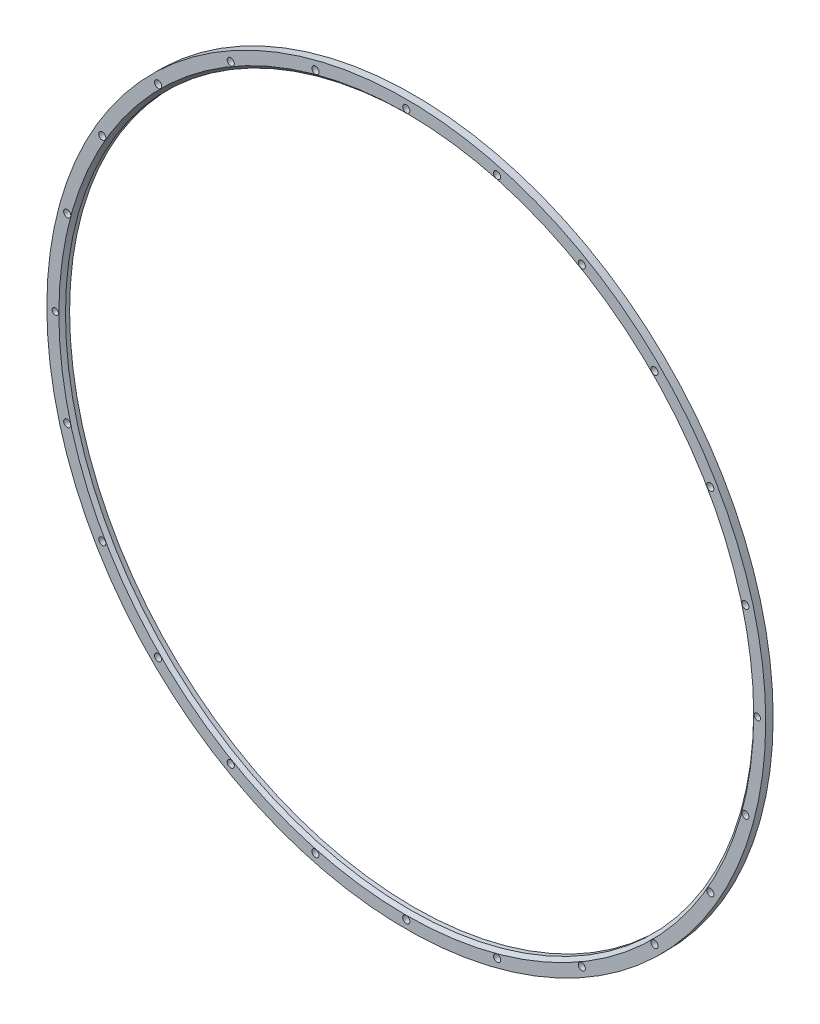
ISO-10303-21;
HEADER;
FILE_DESCRIPTION(('STEP AP214'),'2;1');
FILE_NAME('part.step','',(''),(''),'','','');
FILE_SCHEMA(('AUTOMOTIVE_DESIGN { 1 0 10303 214 1 1 1 1 }'));
ENDSEC;
DATA;
#1=APPLICATION_CONTEXT('core data for automotive mechanical design processes');
#2=APPLICATION_PROTOCOL_DEFINITION('international standard','automotive_design',2000,#1);
#3=PRODUCT_CONTEXT('',#1,'mechanical');
#4=PRODUCT('Part','Part','',(#3));
#5=PRODUCT_RELATED_PRODUCT_CATEGORY('part','',(#4));
#6=PRODUCT_DEFINITION_FORMATION('','',#4);
#7=PRODUCT_DEFINITION_CONTEXT('part definition',#1,'design');
#8=PRODUCT_DEFINITION('design','',#6,#7);
#9=PRODUCT_DEFINITION_SHAPE('','',#8);
#10=(LENGTH_UNIT() NAMED_UNIT(*) SI_UNIT(.MILLI.,.METRE.));
#11=(NAMED_UNIT(*) PLANE_ANGLE_UNIT() SI_UNIT($,.RADIAN.));
#12=(NAMED_UNIT(*) SI_UNIT($,.STERADIAN.) SOLID_ANGLE_UNIT());
#13=UNCERTAINTY_MEASURE_WITH_UNIT(LENGTH_MEASURE(1.E-05),#10,'distance_accuracy_value','');
#14=(GEOMETRIC_REPRESENTATION_CONTEXT(3) GLOBAL_UNCERTAINTY_ASSIGNED_CONTEXT((#13)) GLOBAL_UNIT_ASSIGNED_CONTEXT((#10,
#11,#12)) REPRESENTATION_CONTEXT('',''));
#15=CARTESIAN_POINT('',(0.,0.,0.));
#16=DIRECTION('',(0.,0.,1.));
#17=DIRECTION('',(1.,0.,0.));
#18=AXIS2_PLACEMENT_3D('',#15,#16,#17);
#19=CARTESIAN_POINT('',(0.,0.,4.7));
#20=DIRECTION('',(0.,0.,1.));
#21=DIRECTION('',(1.,0.,0.));
#22=AXIS2_PLACEMENT_3D('',#19,#20,#21);
#23=PLANE('',#22);
#24=CARTESIAN_POINT('',(0.,0.,4.7));
#25=DIRECTION('',(0.,0.,1.));
#26=DIRECTION('',(1.,0.,0.));
#27=AXIS2_PLACEMENT_3D('',#24,#25,#26);
#28=CIRCLE('',#27,219.725);
#29=CARTESIAN_POINT('',(219.725,0.,4.7));
#30=VERTEX_POINT('',#29);
#31=EDGE_CURVE('E43',#30,#30,#28,.F.);
#32=ORIENTED_EDGE('',*,*,#31,.T.);
#33=EDGE_LOOP('',(#32));
#34=FACE_BOUND('',#33,.T.);
#35=CARTESIAN_POINT('',(-57.4578280127567,214.435533436174,4.7));
#36=DIRECTION('',(0.,0.,1.));
#37=DIRECTION('',(0.965925826289072,0.258819045102508,0.));
#38=AXIS2_PLACEMENT_3D('',#35,#36,#37);
#39=CIRCLE('',#38,2.25);
#40=CARTESIAN_POINT('',(-55.2844949036063,215.017876287655,4.7));
#41=VERTEX_POINT('',#40);
#42=EDGE_CURVE('E185',#41,#41,#39,.T.);
#43=ORIENTED_EDGE('',*,*,#42,.F.);
#44=EDGE_LOOP('',(#43));
#45=FACE_BOUND('',#44,.T.);
#46=CARTESIAN_POINT('',(-110.999999999998,192.257639640147,4.7));
#47=DIRECTION('',(0.,0.,1.));
#48=DIRECTION('',(0.866025403784445,0.499999999999989,0.));
#49=AXIS2_PLACEMENT_3D('',#46,#47,#48);
#50=CIRCLE('',#49,2.25);
#51=CARTESIAN_POINT('',(-109.051442841483,193.382639640147,4.7));
#52=VERTEX_POINT('',#51);
#53=EDGE_CURVE('E179',#52,#52,#50,.T.);
#54=ORIENTED_EDGE('',*,*,#53,.F.);
#55=EDGE_LOOP('',(#54));
#56=FACE_BOUND('',#55,.T.);
#57=CARTESIAN_POINT('',(-156.977705423412,156.977705423415,4.7));
#58=DIRECTION('',(0.,0.,1.));
#59=DIRECTION('',(0.707106781186556,0.707106781186539,0.));
#60=AXIS2_PLACEMENT_3D('',#57,#58,#59);
#61=CIRCLE('',#60,2.25);
#62=CARTESIAN_POINT('',(-155.386715165742,158.568695681085,4.7));
#63=VERTEX_POINT('',#62);
#64=EDGE_CURVE('E173',#63,#63,#61,.T.);
#65=ORIENTED_EDGE('',*,*,#64,.F.);
#66=EDGE_LOOP('',(#65));
#67=FACE_BOUND('',#66,.T.);
#68=CARTESIAN_POINT('',(-192.257639640144,111.000000000002,4.7));
#69=DIRECTION('',(0.,0.,1.));
#70=DIRECTION('',(0.50000000000001,0.866025403784433,0.));
#71=AXIS2_PLACEMENT_3D('',#68,#69,#70);
#72=CIRCLE('',#71,2.25);
#73=CARTESIAN_POINT('',(-191.132639640144,112.948557158517,4.7));
#74=VERTEX_POINT('',#73);
#75=EDGE_CURVE('E167',#74,#74,#72,.T.);
#76=ORIENTED_EDGE('',*,*,#75,.F.);
#77=EDGE_LOOP('',(#76));
#78=FACE_BOUND('',#77,.T.);
#79=CARTESIAN_POINT('',(-214.435533436173,57.457828012762,4.7));
#80=DIRECTION('',(0.,0.,1.));
#81=DIRECTION('',(0.258819045102531,0.965925826289065,0.));
#82=AXIS2_PLACEMENT_3D('',#79,#80,#81);
#83=CIRCLE('',#82,2.25);
#84=CARTESIAN_POINT('',(-213.853190584692,59.6311611219124,4.7));
#85=VERTEX_POINT('',#84);
#86=EDGE_CURVE('E161',#85,#85,#83,.T.);
#87=ORIENTED_EDGE('',*,*,#86,.F.);
#88=EDGE_LOOP('',(#87));
#89=FACE_BOUND('',#88,.T.);
#90=CARTESIAN_POINT('',(-214.435533436174,-57.4578280127575,4.7));
#91=DIRECTION('',(0.,0.,1.));
#92=DIRECTION('',(-0.258819045102511,0.965925826289071,0.));
#93=AXIS2_PLACEMENT_3D('',#90,#91,#92);
#94=CIRCLE('',#93,2.25);
#95=CARTESIAN_POINT('',(-215.017876287654,-55.2844949036071,4.7));
#96=VERTEX_POINT('',#95);
#97=EDGE_CURVE('E155',#96,#96,#94,.T.);
#98=ORIENTED_EDGE('',*,*,#97,.F.);
#99=EDGE_LOOP('',(#98));
#100=FACE_BOUND('',#99,.T.);
#101=CARTESIAN_POINT('',(-192.257639640146,-110.999999999998,4.7));
#102=DIRECTION('',(0.,0.,1.));
#103=DIRECTION('',(-0.499999999999992,0.866025403784443,0.));
#104=AXIS2_PLACEMENT_3D('',#101,#102,#103);
#105=CIRCLE('',#104,2.25);
#106=CARTESIAN_POINT('',(-193.382639640146,-109.051442841483,4.7));
#107=VERTEX_POINT('',#106);
#108=EDGE_CURVE('E149',#107,#107,#105,.T.);
#109=ORIENTED_EDGE('',*,*,#108,.F.);
#110=EDGE_LOOP('',(#109));
#111=FACE_BOUND('',#110,.T.);
#112=CARTESIAN_POINT('',(-156.977705423415,-156.977705423412,4.7));
#113=DIRECTION('',(0.,0.,1.));
#114=DIRECTION('',(-0.707106781186541,0.707106781186554,0.));
#115=AXIS2_PLACEMENT_3D('',#112,#113,#114);
#116=CIRCLE('',#115,2.25);
#117=CARTESIAN_POINT('',(-158.568695681085,-155.386715165742,4.7));
#118=VERTEX_POINT('',#117);
#119=EDGE_CURVE('E143',#118,#118,#116,.T.);
#120=ORIENTED_EDGE('',*,*,#119,.F.);
#121=EDGE_LOOP('',(#120));
#122=FACE_BOUND('',#121,.T.);
#123=CARTESIAN_POINT('',(-111.000000000002,-192.257639640144,4.7));
#124=DIRECTION('',(0.,0.,1.));
#125=DIRECTION('',(-0.866025403784435,0.500000000000007,0.));
#126=AXIS2_PLACEMENT_3D('',#123,#124,#125);
#127=CIRCLE('',#126,2.25);
#128=CARTESIAN_POINT('',(-112.948557158517,-191.132639640144,4.7));
#129=VERTEX_POINT('',#128);
#130=EDGE_CURVE('E137',#129,#129,#127,.T.);
#131=ORIENTED_EDGE('',*,*,#130,.F.);
#132=EDGE_LOOP('',(#131));
#133=FACE_BOUND('',#132,.T.);
#134=CARTESIAN_POINT('',(-57.4578280127612,-214.435533436173,4.7));
#135=DIRECTION('',(0.,0.,1.));
#136=DIRECTION('',(-0.965925826289066,0.258819045102528,0.));
#137=AXIS2_PLACEMENT_3D('',#134,#135,#136);
#138=CIRCLE('',#137,2.25);
#139=CARTESIAN_POINT('',(-59.6311611219116,-213.853190584692,4.7));
#140=VERTEX_POINT('',#139);
#141=EDGE_CURVE('E131',#140,#140,#138,.T.);
#142=ORIENTED_EDGE('',*,*,#141,.F.);
#143=EDGE_LOOP('',(#142));
#144=FACE_BOUND('',#143,.T.);
#145=CARTESIAN_POINT('',(0.,-222.,4.7));
#146=DIRECTION('',(0.,0.,1.));
#147=DIRECTION('',(-1.,0.,0.));
#148=AXIS2_PLACEMENT_3D('',#145,#146,#147);
#149=CIRCLE('',#148,2.25);
#150=CARTESIAN_POINT('',(-2.25,-222.,4.7));
#151=VERTEX_POINT('',#150);
#152=EDGE_CURVE('E125',#151,#151,#149,.T.);
#153=ORIENTED_EDGE('',*,*,#152,.F.);
#154=EDGE_LOOP('',(#153));
#155=FACE_BOUND('',#154,.T.);
#156=CARTESIAN_POINT('',(57.4578280127582,-214.435533436174,4.7));
#157=DIRECTION('',(0.,0.,1.));
#158=DIRECTION('',(-0.96592582628907,-0.258819045102515,0.));
#159=AXIS2_PLACEMENT_3D('',#156,#157,#158);
#160=CIRCLE('',#159,2.25);
#161=CARTESIAN_POINT('',(55.2844949036078,-215.017876287654,4.7));
#162=VERTEX_POINT('',#161);
#163=EDGE_CURVE('E119',#162,#162,#160,.T.);
#164=ORIENTED_EDGE('',*,*,#163,.F.);
#165=EDGE_LOOP('',(#164));
#166=FACE_BOUND('',#165,.T.);
#167=CARTESIAN_POINT('',(110.999999999999,-192.257639640146,4.7));
#168=DIRECTION('',(0.,0.,1.));
#169=DIRECTION('',(-0.866025403784442,-0.499999999999995,0.));
#170=AXIS2_PLACEMENT_3D('',#167,#168,#169);
#171=CIRCLE('',#170,2.25);
#172=CARTESIAN_POINT('',(109.051442841484,-193.382639640146,4.7));
#173=VERTEX_POINT('',#172);
#174=EDGE_CURVE('E113',#173,#173,#171,.T.);
#175=ORIENTED_EDGE('',*,*,#174,.F.);
#176=EDGE_LOOP('',(#175));
#177=FACE_BOUND('',#176,.T.);
#178=CARTESIAN_POINT('',(156.977705423413,-156.977705423414,4.7));
#179=DIRECTION('',(0.,0.,1.));
#180=DIRECTION('',(-0.707106781186551,-0.707106781186544,0.));
#181=AXIS2_PLACEMENT_3D('',#178,#179,#180);
#182=CIRCLE('',#181,2.25);
#183=CARTESIAN_POINT('',(155.386715165743,-158.568695681084,4.7));
#184=VERTEX_POINT('',#183);
#185=EDGE_CURVE('E107',#184,#184,#182,.T.);
#186=ORIENTED_EDGE('',*,*,#185,.F.);
#187=EDGE_LOOP('',(#186));
#188=FACE_BOUND('',#187,.T.);
#189=CARTESIAN_POINT('',(192.257639640145,-111.000000000001,4.7));
#190=DIRECTION('',(0.,0.,1.));
#191=DIRECTION('',(-0.500000000000004,-0.866025403784436,0.));
#192=AXIS2_PLACEMENT_3D('',#189,#190,#191);
#193=CIRCLE('',#192,2.25);
#194=CARTESIAN_POINT('',(191.132639640145,-112.948557158516,4.7));
#195=VERTEX_POINT('',#194);
#196=EDGE_CURVE('E101',#195,#195,#193,.T.);
#197=ORIENTED_EDGE('',*,*,#196,.F.);
#198=EDGE_LOOP('',(#197));
#199=FACE_BOUND('',#198,.T.);
#200=CARTESIAN_POINT('',(214.435533436173,-57.4578280127605,4.7));
#201=DIRECTION('',(0.,0.,1.));
#202=DIRECTION('',(-0.258819045102525,-0.965925826289067,0.));
#203=AXIS2_PLACEMENT_3D('',#200,#201,#202);
#204=CIRCLE('',#203,2.25);
#205=CARTESIAN_POINT('',(213.853190584692,-59.6311611219109,4.7));
#206=VERTEX_POINT('',#205);
#207=EDGE_CURVE('E95',#206,#206,#204,.T.);
#208=ORIENTED_EDGE('',*,*,#207,.F.);
#209=EDGE_LOOP('',(#208));
#210=FACE_BOUND('',#209,.T.);
#211=CARTESIAN_POINT('',(214.435533436173,57.457828012759,4.7));
#212=DIRECTION('',(0.,0.,1.));
#213=DIRECTION('',(0.258819045102518,-0.965925826289069,0.));
#214=AXIS2_PLACEMENT_3D('',#211,#212,#213);
#215=CIRCLE('',#214,2.25);
#216=CARTESIAN_POINT('',(215.017876287654,55.2844949036086,4.7));
#217=VERTEX_POINT('',#216);
#218=EDGE_CURVE('E89',#217,#217,#215,.T.);
#219=ORIENTED_EDGE('',*,*,#218,.F.);
#220=EDGE_LOOP('',(#219));
#221=FACE_BOUND('',#220,.T.);
#222=CARTESIAN_POINT('',(192.257639640146,111.,4.7));
#223=DIRECTION('',(0.,0.,1.));
#224=DIRECTION('',(0.499999999999998,-0.86602540378444,0.));
#225=AXIS2_PLACEMENT_3D('',#222,#223,#224);
#226=CIRCLE('',#225,2.25);
#227=CARTESIAN_POINT('',(193.382639640146,109.051442841485,4.7));
#228=VERTEX_POINT('',#227);
#229=EDGE_CURVE('E83',#228,#228,#226,.T.);
#230=ORIENTED_EDGE('',*,*,#229,.F.);
#231=EDGE_LOOP('',(#230));
#232=FACE_BOUND('',#231,.T.);
#233=CARTESIAN_POINT('',(156.977705423414,156.977705423413,4.7));
#234=DIRECTION('',(0.,0.,1.));
#235=DIRECTION('',(0.707106781186546,-0.707106781186549,0.));
#236=AXIS2_PLACEMENT_3D('',#233,#234,#235);
#237=CIRCLE('',#236,2.25);
#238=CARTESIAN_POINT('',(158.568695681084,155.386715165744,4.7));
#239=VERTEX_POINT('',#238);
#240=EDGE_CURVE('E77',#239,#239,#237,.T.);
#241=ORIENTED_EDGE('',*,*,#240,.F.);
#242=EDGE_LOOP('',(#241));
#243=FACE_BOUND('',#242,.T.);
#244=CARTESIAN_POINT('',(111.,192.257639640145,4.7));
#245=DIRECTION('',(0.,0.,1.));
#246=DIRECTION('',(0.866025403784438,-0.500000000000001,0.));
#247=AXIS2_PLACEMENT_3D('',#244,#245,#246);
#248=CIRCLE('',#247,2.25);
#249=CARTESIAN_POINT('',(112.948557158515,191.132639640145,4.7));
#250=VERTEX_POINT('',#249);
#251=EDGE_CURVE('E71',#250,#250,#248,.T.);
#252=ORIENTED_EDGE('',*,*,#251,.F.);
#253=EDGE_LOOP('',(#252));
#254=FACE_BOUND('',#253,.T.);
#255=CARTESIAN_POINT('',(57.4578280127597,214.435533436173,4.7));
#256=DIRECTION('',(0.,0.,1.));
#257=DIRECTION('',(0.965925826289068,-0.258819045102521,0.));
#258=AXIS2_PLACEMENT_3D('',#255,#256,#257);
#259=CIRCLE('',#258,2.25);
#260=CARTESIAN_POINT('',(59.6311611219101,213.853190584692,4.7));
#261=VERTEX_POINT('',#260);
#262=EDGE_CURVE('E65',#261,#261,#259,.T.);
#263=ORIENTED_EDGE('',*,*,#262,.F.);
#264=EDGE_LOOP('',(#263));
#265=FACE_BOUND('',#264,.T.);
#266=CARTESIAN_POINT('',(0.,222.,4.7));
#267=DIRECTION('',(0.,0.,1.));
#268=DIRECTION('',(1.,0.,0.));
#269=AXIS2_PLACEMENT_3D('',#266,#267,#268);
#270=CIRCLE('',#269,2.25);
#271=CARTESIAN_POINT('',(2.25,222.,4.7));
#272=VERTEX_POINT('',#271);
#273=EDGE_CURVE('E62',#272,#272,#270,.T.);
#274=ORIENTED_EDGE('',*,*,#273,.F.);
#275=EDGE_LOOP('',(#274));
#276=FACE_BOUND('',#275,.T.);
#277=CARTESIAN_POINT('',(0.,0.,4.7));
#278=DIRECTION('',(0.,0.,1.));
#279=DIRECTION('',(1.,0.,0.));
#280=AXIS2_PLACEMENT_3D('',#277,#278,#279);
#281=CIRCLE('',#280,227.325);
#282=CARTESIAN_POINT('',(227.325,0.,4.7));
#283=VERTEX_POINT('',#282);
#284=EDGE_CURVE('E47',#283,#283,#281,.T.);
#285=ORIENTED_EDGE('',*,*,#284,.T.);
#286=EDGE_LOOP('',(#285));
#287=FACE_BOUND('',#286,.T.);
#288=CARTESIAN_POINT('',(222.,-7.75108857223176E-13,4.7));
#289=DIRECTION('',(0.,0.,1.));
#290=DIRECTION('',(1.,0.,0.));
#291=AXIS2_PLACEMENT_3D('',#288,#289,#290);
#292=CIRCLE('',#291,2.);
#293=CARTESIAN_POINT('',(224.,-7.75108857223176E-13,4.7));
#294=VERTEX_POINT('',#293);
#295=EDGE_CURVE('E194',#294,#294,#292,.T.);
#296=ORIENTED_EDGE('',*,*,#295,.F.);
#297=EDGE_LOOP('',(#296));
#298=FACE_BOUND('',#297,.T.);
#299=CARTESIAN_POINT('',(-222.,2.32532657166953E-12,4.7));
#300=DIRECTION('',(0.,0.,1.));
#301=DIRECTION('',(1.,0.,0.));
#302=AXIS2_PLACEMENT_3D('',#299,#300,#301);
#303=CIRCLE('',#302,2.);
#304=CARTESIAN_POINT('',(-220.,2.32532657166953E-12,4.7));
#305=VERTEX_POINT('',#304);
#306=EDGE_CURVE('E200',#305,#305,#303,.T.);
#307=ORIENTED_EDGE('',*,*,#306,.F.);
#308=EDGE_LOOP('',(#307));
#309=FACE_BOUND('',#308,.T.);
#310=ADVANCED_FACE('F36',(#34,#45,#56,#67,#78,#89,#100,#111,#122,#133,#144,#155,#166,#177,#188,
#199,#210,#221,#232,#243,#254,#265,#276,#287,#298,#309),#23,.T.);
#311=CARTESIAN_POINT('',(0.,0.,0.));
#312=DIRECTION('',(0.,0.,1.));
#313=DIRECTION('',(1.,0.,0.));
#314=AXIS2_PLACEMENT_3D('',#311,#312,#313);
#315=PLANE('',#314);
#316=CARTESIAN_POINT('',(-57.4578280127567,214.435533436174,0.));
#317=DIRECTION('',(0.,0.,1.));
#318=DIRECTION('',(0.965925826289072,0.258819045102508,0.));
#319=AXIS2_PLACEMENT_3D('',#316,#317,#318);
#320=CIRCLE('',#319,2.25);
#321=CARTESIAN_POINT('',(-55.2844949036063,215.017876287655,0.));
#322=VERTEX_POINT('',#321);
#323=EDGE_CURVE('E188',#322,#322,#320,.T.);
#324=ORIENTED_EDGE('',*,*,#323,.T.);
#325=EDGE_LOOP('',(#324));
#326=FACE_BOUND('',#325,.T.);
#327=CARTESIAN_POINT('',(-110.999999999998,192.257639640147,0.));
#328=DIRECTION('',(0.,0.,1.));
#329=DIRECTION('',(0.866025403784445,0.499999999999989,0.));
#330=AXIS2_PLACEMENT_3D('',#327,#328,#329);
#331=CIRCLE('',#330,2.25);
#332=CARTESIAN_POINT('',(-109.051442841483,193.382639640147,0.));
#333=VERTEX_POINT('',#332);
#334=EDGE_CURVE('E182',#333,#333,#331,.T.);
#335=ORIENTED_EDGE('',*,*,#334,.T.);
#336=EDGE_LOOP('',(#335));
#337=FACE_BOUND('',#336,.T.);
#338=CARTESIAN_POINT('',(-156.977705423412,156.977705423415,0.));
#339=DIRECTION('',(0.,0.,1.));
#340=DIRECTION('',(0.707106781186556,0.707106781186539,0.));
#341=AXIS2_PLACEMENT_3D('',#338,#339,#340);
#342=CIRCLE('',#341,2.25);
#343=CARTESIAN_POINT('',(-155.386715165742,158.568695681085,0.));
#344=VERTEX_POINT('',#343);
#345=EDGE_CURVE('E176',#344,#344,#342,.T.);
#346=ORIENTED_EDGE('',*,*,#345,.T.);
#347=EDGE_LOOP('',(#346));
#348=FACE_BOUND('',#347,.T.);
#349=CARTESIAN_POINT('',(-192.257639640144,111.000000000002,0.));
#350=DIRECTION('',(0.,0.,1.));
#351=DIRECTION('',(0.50000000000001,0.866025403784433,0.));
#352=AXIS2_PLACEMENT_3D('',#349,#350,#351);
#353=CIRCLE('',#352,2.25);
#354=CARTESIAN_POINT('',(-191.132639640144,112.948557158517,0.));
#355=VERTEX_POINT('',#354);
#356=EDGE_CURVE('E170',#355,#355,#353,.T.);
#357=ORIENTED_EDGE('',*,*,#356,.T.);
#358=EDGE_LOOP('',(#357));
#359=FACE_BOUND('',#358,.T.);
#360=CARTESIAN_POINT('',(-214.435533436173,57.457828012762,0.));
#361=DIRECTION('',(0.,0.,1.));
#362=DIRECTION('',(0.258819045102531,0.965925826289065,0.));
#363=AXIS2_PLACEMENT_3D('',#360,#361,#362);
#364=CIRCLE('',#363,2.25);
#365=CARTESIAN_POINT('',(-213.853190584692,59.6311611219124,0.));
#366=VERTEX_POINT('',#365);
#367=EDGE_CURVE('E164',#366,#366,#364,.T.);
#368=ORIENTED_EDGE('',*,*,#367,.T.);
#369=EDGE_LOOP('',(#368));
#370=FACE_BOUND('',#369,.T.);
#371=CARTESIAN_POINT('',(-214.435533436174,-57.4578280127575,0.));
#372=DIRECTION('',(0.,0.,1.));
#373=DIRECTION('',(-0.258819045102511,0.965925826289071,0.));
#374=AXIS2_PLACEMENT_3D('',#371,#372,#373);
#375=CIRCLE('',#374,2.25);
#376=CARTESIAN_POINT('',(-215.017876287654,-55.2844949036071,0.));
#377=VERTEX_POINT('',#376);
#378=EDGE_CURVE('E158',#377,#377,#375,.T.);
#379=ORIENTED_EDGE('',*,*,#378,.T.);
#380=EDGE_LOOP('',(#379));
#381=FACE_BOUND('',#380,.T.);
#382=CARTESIAN_POINT('',(-192.257639640146,-110.999999999998,0.));
#383=DIRECTION('',(0.,0.,1.));
#384=DIRECTION('',(-0.499999999999992,0.866025403784443,0.));
#385=AXIS2_PLACEMENT_3D('',#382,#383,#384);
#386=CIRCLE('',#385,2.25);
#387=CARTESIAN_POINT('',(-193.382639640146,-109.051442841483,0.));
#388=VERTEX_POINT('',#387);
#389=EDGE_CURVE('E152',#388,#388,#386,.T.);
#390=ORIENTED_EDGE('',*,*,#389,.T.);
#391=EDGE_LOOP('',(#390));
#392=FACE_BOUND('',#391,.T.);
#393=CARTESIAN_POINT('',(-156.977705423415,-156.977705423412,0.));
#394=DIRECTION('',(0.,0.,1.));
#395=DIRECTION('',(-0.707106781186541,0.707106781186554,0.));
#396=AXIS2_PLACEMENT_3D('',#393,#394,#395);
#397=CIRCLE('',#396,2.25);
#398=CARTESIAN_POINT('',(-158.568695681085,-155.386715165742,0.));
#399=VERTEX_POINT('',#398);
#400=EDGE_CURVE('E146',#399,#399,#397,.T.);
#401=ORIENTED_EDGE('',*,*,#400,.T.);
#402=EDGE_LOOP('',(#401));
#403=FACE_BOUND('',#402,.T.);
#404=CARTESIAN_POINT('',(-111.000000000002,-192.257639640144,0.));
#405=DIRECTION('',(0.,0.,1.));
#406=DIRECTION('',(-0.866025403784435,0.500000000000007,0.));
#407=AXIS2_PLACEMENT_3D('',#404,#405,#406);
#408=CIRCLE('',#407,2.25);
#409=CARTESIAN_POINT('',(-112.948557158517,-191.132639640144,0.));
#410=VERTEX_POINT('',#409);
#411=EDGE_CURVE('E140',#410,#410,#408,.T.);
#412=ORIENTED_EDGE('',*,*,#411,.T.);
#413=EDGE_LOOP('',(#412));
#414=FACE_BOUND('',#413,.T.);
#415=CARTESIAN_POINT('',(-57.4578280127612,-214.435533436173,0.));
#416=DIRECTION('',(0.,0.,1.));
#417=DIRECTION('',(-0.965925826289066,0.258819045102528,0.));
#418=AXIS2_PLACEMENT_3D('',#415,#416,#417);
#419=CIRCLE('',#418,2.25);
#420=CARTESIAN_POINT('',(-59.6311611219116,-213.853190584692,0.));
#421=VERTEX_POINT('',#420);
#422=EDGE_CURVE('E134',#421,#421,#419,.T.);
#423=ORIENTED_EDGE('',*,*,#422,.T.);
#424=EDGE_LOOP('',(#423));
#425=FACE_BOUND('',#424,.T.);
#426=CARTESIAN_POINT('',(0.,-222.,0.));
#427=DIRECTION('',(0.,0.,1.));
#428=DIRECTION('',(-1.,0.,0.));
#429=AXIS2_PLACEMENT_3D('',#426,#427,#428);
#430=CIRCLE('',#429,2.25);
#431=CARTESIAN_POINT('',(-2.25,-222.,0.));
#432=VERTEX_POINT('',#431);
#433=EDGE_CURVE('E128',#432,#432,#430,.T.);
#434=ORIENTED_EDGE('',*,*,#433,.T.);
#435=EDGE_LOOP('',(#434));
#436=FACE_BOUND('',#435,.T.);
#437=CARTESIAN_POINT('',(57.4578280127582,-214.435533436174,0.));
#438=DIRECTION('',(0.,0.,1.));
#439=DIRECTION('',(-0.96592582628907,-0.258819045102515,0.));
#440=AXIS2_PLACEMENT_3D('',#437,#438,#439);
#441=CIRCLE('',#440,2.25);
#442=CARTESIAN_POINT('',(55.2844949036078,-215.017876287654,0.));
#443=VERTEX_POINT('',#442);
#444=EDGE_CURVE('E122',#443,#443,#441,.T.);
#445=ORIENTED_EDGE('',*,*,#444,.T.);
#446=EDGE_LOOP('',(#445));
#447=FACE_BOUND('',#446,.T.);
#448=CARTESIAN_POINT('',(110.999999999999,-192.257639640146,0.));
#449=DIRECTION('',(0.,0.,1.));
#450=DIRECTION('',(-0.866025403784442,-0.499999999999995,0.));
#451=AXIS2_PLACEMENT_3D('',#448,#449,#450);
#452=CIRCLE('',#451,2.25);
#453=CARTESIAN_POINT('',(109.051442841484,-193.382639640146,0.));
#454=VERTEX_POINT('',#453);
#455=EDGE_CURVE('E116',#454,#454,#452,.T.);
#456=ORIENTED_EDGE('',*,*,#455,.T.);
#457=EDGE_LOOP('',(#456));
#458=FACE_BOUND('',#457,.T.);
#459=CARTESIAN_POINT('',(156.977705423413,-156.977705423414,0.));
#460=DIRECTION('',(0.,0.,1.));
#461=DIRECTION('',(-0.707106781186551,-0.707106781186544,0.));
#462=AXIS2_PLACEMENT_3D('',#459,#460,#461);
#463=CIRCLE('',#462,2.25);
#464=CARTESIAN_POINT('',(155.386715165743,-158.568695681084,0.));
#465=VERTEX_POINT('',#464);
#466=EDGE_CURVE('E110',#465,#465,#463,.T.);
#467=ORIENTED_EDGE('',*,*,#466,.T.);
#468=EDGE_LOOP('',(#467));
#469=FACE_BOUND('',#468,.T.);
#470=CARTESIAN_POINT('',(192.257639640145,-111.000000000001,0.));
#471=DIRECTION('',(0.,0.,1.));
#472=DIRECTION('',(-0.500000000000004,-0.866025403784436,0.));
#473=AXIS2_PLACEMENT_3D('',#470,#471,#472);
#474=CIRCLE('',#473,2.25);
#475=CARTESIAN_POINT('',(191.132639640145,-112.948557158516,0.));
#476=VERTEX_POINT('',#475);
#477=EDGE_CURVE('E104',#476,#476,#474,.T.);
#478=ORIENTED_EDGE('',*,*,#477,.T.);
#479=EDGE_LOOP('',(#478));
#480=FACE_BOUND('',#479,.T.);
#481=CARTESIAN_POINT('',(214.435533436173,-57.4578280127605,0.));
#482=DIRECTION('',(0.,0.,1.));
#483=DIRECTION('',(-0.258819045102525,-0.965925826289067,0.));
#484=AXIS2_PLACEMENT_3D('',#481,#482,#483);
#485=CIRCLE('',#484,2.25);
#486=CARTESIAN_POINT('',(213.853190584692,-59.6311611219109,0.));
#487=VERTEX_POINT('',#486);
#488=EDGE_CURVE('E98',#487,#487,#485,.T.);
#489=ORIENTED_EDGE('',*,*,#488,.T.);
#490=EDGE_LOOP('',(#489));
#491=FACE_BOUND('',#490,.T.);
#492=CARTESIAN_POINT('',(214.435533436173,57.457828012759,0.));
#493=DIRECTION('',(0.,0.,1.));
#494=DIRECTION('',(0.258819045102518,-0.965925826289069,0.));
#495=AXIS2_PLACEMENT_3D('',#492,#493,#494);
#496=CIRCLE('',#495,2.25);
#497=CARTESIAN_POINT('',(215.017876287654,55.2844949036086,0.));
#498=VERTEX_POINT('',#497);
#499=EDGE_CURVE('E92',#498,#498,#496,.T.);
#500=ORIENTED_EDGE('',*,*,#499,.T.);
#501=EDGE_LOOP('',(#500));
#502=FACE_BOUND('',#501,.T.);
#503=CARTESIAN_POINT('',(192.257639640146,111.,0.));
#504=DIRECTION('',(0.,0.,1.));
#505=DIRECTION('',(0.499999999999998,-0.86602540378444,0.));
#506=AXIS2_PLACEMENT_3D('',#503,#504,#505);
#507=CIRCLE('',#506,2.25);
#508=CARTESIAN_POINT('',(193.382639640146,109.051442841485,0.));
#509=VERTEX_POINT('',#508);
#510=EDGE_CURVE('E86',#509,#509,#507,.T.);
#511=ORIENTED_EDGE('',*,*,#510,.T.);
#512=EDGE_LOOP('',(#511));
#513=FACE_BOUND('',#512,.T.);
#514=CARTESIAN_POINT('',(156.977705423414,156.977705423413,0.));
#515=DIRECTION('',(0.,0.,1.));
#516=DIRECTION('',(0.707106781186546,-0.707106781186549,0.));
#517=AXIS2_PLACEMENT_3D('',#514,#515,#516);
#518=CIRCLE('',#517,2.25);
#519=CARTESIAN_POINT('',(158.568695681084,155.386715165744,0.));
#520=VERTEX_POINT('',#519);
#521=EDGE_CURVE('E80',#520,#520,#518,.T.);
#522=ORIENTED_EDGE('',*,*,#521,.T.);
#523=EDGE_LOOP('',(#522));
#524=FACE_BOUND('',#523,.T.);
#525=CARTESIAN_POINT('',(111.,192.257639640145,0.));
#526=DIRECTION('',(0.,0.,1.));
#527=DIRECTION('',(0.866025403784438,-0.500000000000001,0.));
#528=AXIS2_PLACEMENT_3D('',#525,#526,#527);
#529=CIRCLE('',#528,2.25);
#530=CARTESIAN_POINT('',(112.948557158515,191.132639640145,0.));
#531=VERTEX_POINT('',#530);
#532=EDGE_CURVE('E74',#531,#531,#529,.T.);
#533=ORIENTED_EDGE('',*,*,#532,.T.);
#534=EDGE_LOOP('',(#533));
#535=FACE_BOUND('',#534,.T.);
#536=CARTESIAN_POINT('',(57.4578280127597,214.435533436173,0.));
#537=DIRECTION('',(0.,0.,1.));
#538=DIRECTION('',(0.965925826289068,-0.258819045102521,0.));
#539=AXIS2_PLACEMENT_3D('',#536,#537,#538);
#540=CIRCLE('',#539,2.25);
#541=CARTESIAN_POINT('',(59.6311611219101,213.853190584692,0.));
#542=VERTEX_POINT('',#541);
#543=EDGE_CURVE('E68',#542,#542,#540,.T.);
#544=ORIENTED_EDGE('',*,*,#543,.T.);
#545=EDGE_LOOP('',(#544));
#546=FACE_BOUND('',#545,.T.);
#547=CARTESIAN_POINT('',(0.,222.,0.));
#548=DIRECTION('',(0.,0.,1.));
#549=DIRECTION('',(1.,0.,0.));
#550=AXIS2_PLACEMENT_3D('',#547,#548,#549);
#551=CIRCLE('',#550,2.25);
#552=CARTESIAN_POINT('',(2.25,222.,0.));
#553=VERTEX_POINT('',#552);
#554=EDGE_CURVE('E59',#553,#553,#551,.T.);
#555=ORIENTED_EDGE('',*,*,#554,.T.);
#556=EDGE_LOOP('',(#555));
#557=FACE_BOUND('',#556,.T.);
#558=CARTESIAN_POINT('',(0.,0.,0.));
#559=DIRECTION('',(0.,0.,-1.));
#560=DIRECTION('',(-1.,0.,0.));
#561=AXIS2_PLACEMENT_3D('',#558,#559,#560);
#562=CIRCLE('',#561,217.625);
#563=CARTESIAN_POINT('',(-217.625,0.,0.));
#564=VERTEX_POINT('',#563);
#565=EDGE_CURVE('E55',#564,#564,#562,.T.);
#566=ORIENTED_EDGE('',*,*,#565,.F.);
#567=EDGE_LOOP('',(#566));
#568=FACE_BOUND('',#567,.T.);
#569=CARTESIAN_POINT('',(0.,0.,0.));
#570=DIRECTION('',(0.,0.,1.));
#571=DIRECTION('',(1.,0.,0.));
#572=AXIS2_PLACEMENT_3D('',#569,#570,#571);
#573=CIRCLE('',#572,227.325);
#574=CARTESIAN_POINT('',(227.325,0.,0.));
#575=VERTEX_POINT('',#574);
#576=EDGE_CURVE('E51',#575,#575,#573,.T.);
#577=ORIENTED_EDGE('',*,*,#576,.F.);
#578=EDGE_LOOP('',(#577));
#579=FACE_BOUND('',#578,.T.);
#580=CARTESIAN_POINT('',(222.,-7.75108857223176E-13,0.));
#581=DIRECTION('',(0.,0.,1.));
#582=DIRECTION('',(1.,0.,0.));
#583=AXIS2_PLACEMENT_3D('',#580,#581,#582);
#584=CIRCLE('',#583,2.);
#585=CARTESIAN_POINT('',(224.,-7.75108857223176E-13,0.));
#586=VERTEX_POINT('',#585);
#587=EDGE_CURVE('E191',#586,#586,#584,.F.);
#588=ORIENTED_EDGE('',*,*,#587,.F.);
#589=EDGE_LOOP('',(#588));
#590=FACE_BOUND('',#589,.T.);
#591=CARTESIAN_POINT('',(-222.,2.32532657166953E-12,0.));
#592=DIRECTION('',(0.,0.,1.));
#593=DIRECTION('',(1.,0.,0.));
#594=AXIS2_PLACEMENT_3D('',#591,#592,#593);
#595=CIRCLE('',#594,2.);
#596=CARTESIAN_POINT('',(-220.,2.32532657166953E-12,0.));
#597=VERTEX_POINT('',#596);
#598=EDGE_CURVE('E197',#597,#597,#595,.F.);
#599=ORIENTED_EDGE('',*,*,#598,.F.);
#600=EDGE_LOOP('',(#599));
#601=FACE_BOUND('',#600,.T.);
#602=ADVANCED_FACE('F207',(#326,#337,#348,#359,#370,#381,#392,#403,#414,#425,#436,#447,#458,
#469,#480,#491,#502,#513,#524,#535,#546,#557,#568,#579,#590,#601),#315,.F.);
#603=CARTESIAN_POINT('',(0.,0.,4.7));
#604=DIRECTION('',(0.,0.,-1.));
#605=DIRECTION('',(-1.,0.,0.));
#606=AXIS2_PLACEMENT_3D('',#603,#604,#605);
#607=CYLINDRICAL_SURFACE('',#606,227.325);
#608=ORIENTED_EDGE('',*,*,#284,.F.);
#609=EDGE_LOOP('',(#608));
#610=FACE_BOUND('',#609,.T.);
#611=ORIENTED_EDGE('',*,*,#576,.T.);
#612=EDGE_LOOP('',(#611));
#613=FACE_BOUND('',#612,.T.);
#614=ADVANCED_FACE('F212',(#610,#613),#607,.T.);
#615=CARTESIAN_POINT('',(0.,0.,4.7));
#616=DIRECTION('',(0.,0.,-1.));
#617=DIRECTION('',(-1.,0.,0.));
#618=AXIS2_PLACEMENT_3D('',#615,#616,#617);
#619=CYLINDRICAL_SURFACE('',#618,217.625);
#620=CARTESIAN_POINT('',(0.,0.,2.60000000000001));
#621=DIRECTION('',(0.,0.,1.));
#622=DIRECTION('',(1.,0.,0.));
#623=AXIS2_PLACEMENT_3D('',#620,#621,#622);
#624=CIRCLE('',#623,217.625);
#625=CARTESIAN_POINT('',(217.625,0.,2.60000000000001));
#626=VERTEX_POINT('',#625);
#627=EDGE_CURVE('E10',#626,#626,#624,.T.);
#628=ORIENTED_EDGE('',*,*,#627,.T.);
#629=EDGE_LOOP('',(#628));
#630=FACE_BOUND('',#629,.T.);
#631=ORIENTED_EDGE('',*,*,#565,.T.);
#632=EDGE_LOOP('',(#631));
#633=FACE_BOUND('',#632,.T.);
#634=ADVANCED_FACE('F217',(#630,#633),#619,.F.);
#635=CARTESIAN_POINT('',(0.,222.,4.7));
#636=DIRECTION('',(0.,0.,1.));
#637=DIRECTION('',(1.,0.,0.));
#638=AXIS2_PLACEMENT_3D('',#635,#636,#637);
#639=CYLINDRICAL_SURFACE('',#638,2.25);
#640=ORIENTED_EDGE('',*,*,#554,.F.);
#641=EDGE_LOOP('',(#640));
#642=FACE_BOUND('',#641,.T.);
#643=ORIENTED_EDGE('',*,*,#273,.T.);
#644=EDGE_LOOP('',(#643));
#645=FACE_BOUND('',#644,.T.);
#646=ADVANCED_FACE('F224',(#642,#645),#639,.F.);
#647=CARTESIAN_POINT('',(57.4578280127597,214.435533436173,4.7));
#648=DIRECTION('',(0.,0.,1.));
#649=DIRECTION('',(0.965925826289068,-0.258819045102521,0.));
#650=AXIS2_PLACEMENT_3D('',#647,#648,#649);
#651=CYLINDRICAL_SURFACE('',#650,2.25);
#652=ORIENTED_EDGE('',*,*,#543,.F.);
#653=EDGE_LOOP('',(#652));
#654=FACE_BOUND('',#653,.T.);
#655=ORIENTED_EDGE('',*,*,#262,.T.);
#656=EDGE_LOOP('',(#655));
#657=FACE_BOUND('',#656,.T.);
#658=ADVANCED_FACE('F324',(#654,#657),#651,.F.);
#659=CARTESIAN_POINT('',(111.,192.257639640145,4.7));
#660=DIRECTION('',(0.,0.,1.));
#661=DIRECTION('',(0.866025403784438,-0.500000000000001,0.));
#662=AXIS2_PLACEMENT_3D('',#659,#660,#661);
#663=CYLINDRICAL_SURFACE('',#662,2.25);
#664=ORIENTED_EDGE('',*,*,#532,.F.);
#665=EDGE_LOOP('',(#664));
#666=FACE_BOUND('',#665,.T.);
#667=ORIENTED_EDGE('',*,*,#251,.T.);
#668=EDGE_LOOP('',(#667));
#669=FACE_BOUND('',#668,.T.);
#670=ADVANCED_FACE('F320',(#666,#669),#663,.F.);
#671=CARTESIAN_POINT('',(156.977705423414,156.977705423413,4.7));
#672=DIRECTION('',(0.,0.,1.));
#673=DIRECTION('',(0.707106781186546,-0.707106781186549,0.));
#674=AXIS2_PLACEMENT_3D('',#671,#672,#673);
#675=CYLINDRICAL_SURFACE('',#674,2.25);
#676=ORIENTED_EDGE('',*,*,#521,.F.);
#677=EDGE_LOOP('',(#676));
#678=FACE_BOUND('',#677,.T.);
#679=ORIENTED_EDGE('',*,*,#240,.T.);
#680=EDGE_LOOP('',(#679));
#681=FACE_BOUND('',#680,.T.);
#682=ADVANCED_FACE('F316',(#678,#681),#675,.F.);
#683=CARTESIAN_POINT('',(192.257639640146,111.,4.7));
#684=DIRECTION('',(0.,0.,1.));
#685=DIRECTION('',(0.499999999999998,-0.86602540378444,0.));
#686=AXIS2_PLACEMENT_3D('',#683,#684,#685);
#687=CYLINDRICAL_SURFACE('',#686,2.25);
#688=ORIENTED_EDGE('',*,*,#510,.F.);
#689=EDGE_LOOP('',(#688));
#690=FACE_BOUND('',#689,.T.);
#691=ORIENTED_EDGE('',*,*,#229,.T.);
#692=EDGE_LOOP('',(#691));
#693=FACE_BOUND('',#692,.T.);
#694=ADVANCED_FACE('F312',(#690,#693),#687,.F.);
#695=CARTESIAN_POINT('',(214.435533436173,57.457828012759,4.7));
#696=DIRECTION('',(0.,0.,1.));
#697=DIRECTION('',(0.258819045102518,-0.965925826289069,0.));
#698=AXIS2_PLACEMENT_3D('',#695,#696,#697);
#699=CYLINDRICAL_SURFACE('',#698,2.25);
#700=ORIENTED_EDGE('',*,*,#499,.F.);
#701=EDGE_LOOP('',(#700));
#702=FACE_BOUND('',#701,.T.);
#703=ORIENTED_EDGE('',*,*,#218,.T.);
#704=EDGE_LOOP('',(#703));
#705=FACE_BOUND('',#704,.T.);
#706=ADVANCED_FACE('F308',(#702,#705),#699,.F.);
#707=CARTESIAN_POINT('',(214.435533436173,-57.4578280127605,4.7));
#708=DIRECTION('',(0.,0.,1.));
#709=DIRECTION('',(-0.258819045102525,-0.965925826289067,0.));
#710=AXIS2_PLACEMENT_3D('',#707,#708,#709);
#711=CYLINDRICAL_SURFACE('',#710,2.25);
#712=ORIENTED_EDGE('',*,*,#488,.F.);
#713=EDGE_LOOP('',(#712));
#714=FACE_BOUND('',#713,.T.);
#715=ORIENTED_EDGE('',*,*,#207,.T.);
#716=EDGE_LOOP('',(#715));
#717=FACE_BOUND('',#716,.T.);
#718=ADVANCED_FACE('F304',(#714,#717),#711,.F.);
#719=CARTESIAN_POINT('',(192.257639640145,-111.000000000001,4.7));
#720=DIRECTION('',(0.,0.,1.));
#721=DIRECTION('',(-0.500000000000004,-0.866025403784436,0.));
#722=AXIS2_PLACEMENT_3D('',#719,#720,#721);
#723=CYLINDRICAL_SURFACE('',#722,2.25);
#724=ORIENTED_EDGE('',*,*,#477,.F.);
#725=EDGE_LOOP('',(#724));
#726=FACE_BOUND('',#725,.T.);
#727=ORIENTED_EDGE('',*,*,#196,.T.);
#728=EDGE_LOOP('',(#727));
#729=FACE_BOUND('',#728,.T.);
#730=ADVANCED_FACE('F300',(#726,#729),#723,.F.);
#731=CARTESIAN_POINT('',(156.977705423413,-156.977705423414,4.7));
#732=DIRECTION('',(0.,0.,1.));
#733=DIRECTION('',(-0.707106781186551,-0.707106781186544,0.));
#734=AXIS2_PLACEMENT_3D('',#731,#732,#733);
#735=CYLINDRICAL_SURFACE('',#734,2.25);
#736=ORIENTED_EDGE('',*,*,#466,.F.);
#737=EDGE_LOOP('',(#736));
#738=FACE_BOUND('',#737,.T.);
#739=ORIENTED_EDGE('',*,*,#185,.T.);
#740=EDGE_LOOP('',(#739));
#741=FACE_BOUND('',#740,.T.);
#742=ADVANCED_FACE('F296',(#738,#741),#735,.F.);
#743=CARTESIAN_POINT('',(110.999999999999,-192.257639640146,4.7));
#744=DIRECTION('',(0.,0.,1.));
#745=DIRECTION('',(-0.866025403784442,-0.499999999999995,0.));
#746=AXIS2_PLACEMENT_3D('',#743,#744,#745);
#747=CYLINDRICAL_SURFACE('',#746,2.25);
#748=ORIENTED_EDGE('',*,*,#455,.F.);
#749=EDGE_LOOP('',(#748));
#750=FACE_BOUND('',#749,.T.);
#751=ORIENTED_EDGE('',*,*,#174,.T.);
#752=EDGE_LOOP('',(#751));
#753=FACE_BOUND('',#752,.T.);
#754=ADVANCED_FACE('F292',(#750,#753),#747,.F.);
#755=CARTESIAN_POINT('',(57.4578280127582,-214.435533436174,4.7));
#756=DIRECTION('',(0.,0.,1.));
#757=DIRECTION('',(-0.96592582628907,-0.258819045102515,0.));
#758=AXIS2_PLACEMENT_3D('',#755,#756,#757);
#759=CYLINDRICAL_SURFACE('',#758,2.25);
#760=ORIENTED_EDGE('',*,*,#444,.F.);
#761=EDGE_LOOP('',(#760));
#762=FACE_BOUND('',#761,.T.);
#763=ORIENTED_EDGE('',*,*,#163,.T.);
#764=EDGE_LOOP('',(#763));
#765=FACE_BOUND('',#764,.T.);
#766=ADVANCED_FACE('F288',(#762,#765),#759,.F.);
#767=CARTESIAN_POINT('',(0.,-222.,4.7));
#768=DIRECTION('',(0.,0.,1.));
#769=DIRECTION('',(-1.,0.,0.));
#770=AXIS2_PLACEMENT_3D('',#767,#768,#769);
#771=CYLINDRICAL_SURFACE('',#770,2.25);
#772=ORIENTED_EDGE('',*,*,#433,.F.);
#773=EDGE_LOOP('',(#772));
#774=FACE_BOUND('',#773,.T.);
#775=ORIENTED_EDGE('',*,*,#152,.T.);
#776=EDGE_LOOP('',(#775));
#777=FACE_BOUND('',#776,.T.);
#778=ADVANCED_FACE('F284',(#774,#777),#771,.F.);
#779=CARTESIAN_POINT('',(-57.4578280127612,-214.435533436173,4.7));
#780=DIRECTION('',(0.,0.,1.));
#781=DIRECTION('',(-0.965925826289066,0.258819045102528,0.));
#782=AXIS2_PLACEMENT_3D('',#779,#780,#781);
#783=CYLINDRICAL_SURFACE('',#782,2.25);
#784=ORIENTED_EDGE('',*,*,#422,.F.);
#785=EDGE_LOOP('',(#784));
#786=FACE_BOUND('',#785,.T.);
#787=ORIENTED_EDGE('',*,*,#141,.T.);
#788=EDGE_LOOP('',(#787));
#789=FACE_BOUND('',#788,.T.);
#790=ADVANCED_FACE('F280',(#786,#789),#783,.F.);
#791=CARTESIAN_POINT('',(-111.000000000002,-192.257639640144,4.7));
#792=DIRECTION('',(0.,0.,1.));
#793=DIRECTION('',(-0.866025403784435,0.500000000000007,0.));
#794=AXIS2_PLACEMENT_3D('',#791,#792,#793);
#795=CYLINDRICAL_SURFACE('',#794,2.25);
#796=ORIENTED_EDGE('',*,*,#411,.F.);
#797=EDGE_LOOP('',(#796));
#798=FACE_BOUND('',#797,.T.);
#799=ORIENTED_EDGE('',*,*,#130,.T.);
#800=EDGE_LOOP('',(#799));
#801=FACE_BOUND('',#800,.T.);
#802=ADVANCED_FACE('F276',(#798,#801),#795,.F.);
#803=CARTESIAN_POINT('',(-156.977705423415,-156.977705423412,4.7));
#804=DIRECTION('',(0.,0.,1.));
#805=DIRECTION('',(-0.707106781186541,0.707106781186554,0.));
#806=AXIS2_PLACEMENT_3D('',#803,#804,#805);
#807=CYLINDRICAL_SURFACE('',#806,2.25);
#808=ORIENTED_EDGE('',*,*,#400,.F.);
#809=EDGE_LOOP('',(#808));
#810=FACE_BOUND('',#809,.T.);
#811=ORIENTED_EDGE('',*,*,#119,.T.);
#812=EDGE_LOOP('',(#811));
#813=FACE_BOUND('',#812,.T.);
#814=ADVANCED_FACE('F272',(#810,#813),#807,.F.);
#815=CARTESIAN_POINT('',(-192.257639640146,-110.999999999998,4.7));
#816=DIRECTION('',(0.,0.,1.));
#817=DIRECTION('',(-0.499999999999992,0.866025403784443,0.));
#818=AXIS2_PLACEMENT_3D('',#815,#816,#817);
#819=CYLINDRICAL_SURFACE('',#818,2.25);
#820=ORIENTED_EDGE('',*,*,#389,.F.);
#821=EDGE_LOOP('',(#820));
#822=FACE_BOUND('',#821,.T.);
#823=ORIENTED_EDGE('',*,*,#108,.T.);
#824=EDGE_LOOP('',(#823));
#825=FACE_BOUND('',#824,.T.);
#826=ADVANCED_FACE('F268',(#822,#825),#819,.F.);
#827=CARTESIAN_POINT('',(-214.435533436174,-57.4578280127575,4.7));
#828=DIRECTION('',(0.,0.,1.));
#829=DIRECTION('',(-0.258819045102511,0.965925826289071,0.));
#830=AXIS2_PLACEMENT_3D('',#827,#828,#829);
#831=CYLINDRICAL_SURFACE('',#830,2.25);
#832=ORIENTED_EDGE('',*,*,#378,.F.);
#833=EDGE_LOOP('',(#832));
#834=FACE_BOUND('',#833,.T.);
#835=ORIENTED_EDGE('',*,*,#97,.T.);
#836=EDGE_LOOP('',(#835));
#837=FACE_BOUND('',#836,.T.);
#838=ADVANCED_FACE('F264',(#834,#837),#831,.F.);
#839=CARTESIAN_POINT('',(-214.435533436173,57.457828012762,4.7));
#840=DIRECTION('',(0.,0.,1.));
#841=DIRECTION('',(0.258819045102531,0.965925826289065,0.));
#842=AXIS2_PLACEMENT_3D('',#839,#840,#841);
#843=CYLINDRICAL_SURFACE('',#842,2.25);
#844=ORIENTED_EDGE('',*,*,#367,.F.);
#845=EDGE_LOOP('',(#844));
#846=FACE_BOUND('',#845,.T.);
#847=ORIENTED_EDGE('',*,*,#86,.T.);
#848=EDGE_LOOP('',(#847));
#849=FACE_BOUND('',#848,.T.);
#850=ADVANCED_FACE('F260',(#846,#849),#843,.F.);
#851=CARTESIAN_POINT('',(-192.257639640144,111.000000000002,4.7));
#852=DIRECTION('',(0.,0.,1.));
#853=DIRECTION('',(0.50000000000001,0.866025403784433,0.));
#854=AXIS2_PLACEMENT_3D('',#851,#852,#853);
#855=CYLINDRICAL_SURFACE('',#854,2.25);
#856=ORIENTED_EDGE('',*,*,#356,.F.);
#857=EDGE_LOOP('',(#856));
#858=FACE_BOUND('',#857,.T.);
#859=ORIENTED_EDGE('',*,*,#75,.T.);
#860=EDGE_LOOP('',(#859));
#861=FACE_BOUND('',#860,.T.);
#862=ADVANCED_FACE('F256',(#858,#861),#855,.F.);
#863=CARTESIAN_POINT('',(-156.977705423412,156.977705423415,4.7));
#864=DIRECTION('',(0.,0.,1.));
#865=DIRECTION('',(0.707106781186556,0.707106781186539,0.));
#866=AXIS2_PLACEMENT_3D('',#863,#864,#865);
#867=CYLINDRICAL_SURFACE('',#866,2.25);
#868=ORIENTED_EDGE('',*,*,#345,.F.);
#869=EDGE_LOOP('',(#868));
#870=FACE_BOUND('',#869,.T.);
#871=ORIENTED_EDGE('',*,*,#64,.T.);
#872=EDGE_LOOP('',(#871));
#873=FACE_BOUND('',#872,.T.);
#874=ADVANCED_FACE('F252',(#870,#873),#867,.F.);
#875=CARTESIAN_POINT('',(-110.999999999998,192.257639640147,4.7));
#876=DIRECTION('',(0.,0.,1.));
#877=DIRECTION('',(0.866025403784445,0.499999999999989,0.));
#878=AXIS2_PLACEMENT_3D('',#875,#876,#877);
#879=CYLINDRICAL_SURFACE('',#878,2.25);
#880=ORIENTED_EDGE('',*,*,#334,.F.);
#881=EDGE_LOOP('',(#880));
#882=FACE_BOUND('',#881,.T.);
#883=ORIENTED_EDGE('',*,*,#53,.T.);
#884=EDGE_LOOP('',(#883));
#885=FACE_BOUND('',#884,.T.);
#886=ADVANCED_FACE('F248',(#882,#885),#879,.F.);
#887=CARTESIAN_POINT('',(-57.4578280127567,214.435533436174,4.7));
#888=DIRECTION('',(0.,0.,1.));
#889=DIRECTION('',(0.965925826289072,0.258819045102508,0.));
#890=AXIS2_PLACEMENT_3D('',#887,#888,#889);
#891=CYLINDRICAL_SURFACE('',#890,2.25);
#892=ORIENTED_EDGE('',*,*,#323,.F.);
#893=EDGE_LOOP('',(#892));
#894=FACE_BOUND('',#893,.T.);
#895=ORIENTED_EDGE('',*,*,#42,.T.);
#896=EDGE_LOOP('',(#895));
#897=FACE_BOUND('',#896,.T.);
#898=ADVANCED_FACE('F242',(#894,#897),#891,.F.);
#899=CARTESIAN_POINT('',(222.,-7.75108857223176E-13,-6.36396103067894));
#900=DIRECTION('',(0.,0.,1.));
#901=DIRECTION('',(1.,0.,0.));
#902=AXIS2_PLACEMENT_3D('',#899,#900,#901);
#903=CYLINDRICAL_SURFACE('',#902,2.);
#904=ORIENTED_EDGE('',*,*,#587,.T.);
#905=EDGE_LOOP('',(#904));
#906=FACE_BOUND('',#905,.T.);
#907=ORIENTED_EDGE('',*,*,#295,.T.);
#908=EDGE_LOOP('',(#907));
#909=FACE_BOUND('',#908,.T.);
#910=ADVANCED_FACE('F235',(#906,#909),#903,.F.);
#911=CARTESIAN_POINT('',(-222.,2.32532657166953E-12,-6.36396103067894));
#912=DIRECTION('',(0.,0.,1.));
#913=DIRECTION('',(1.,0.,0.));
#914=AXIS2_PLACEMENT_3D('',#911,#912,#913);
#915=CYLINDRICAL_SURFACE('',#914,2.);
#916=ORIENTED_EDGE('',*,*,#598,.T.);
#917=EDGE_LOOP('',(#916));
#918=FACE_BOUND('',#917,.T.);
#919=ORIENTED_EDGE('',*,*,#306,.T.);
#920=EDGE_LOOP('',(#919));
#921=FACE_BOUND('',#920,.T.);
#922=ADVANCED_FACE('F204',(#918,#921),#915,.F.);
#923=CARTESIAN_POINT('',(0.,0.,4.7));
#924=DIRECTION('',(0.,0.,1.));
#925=DIRECTION('',(1.,0.,0.));
#926=AXIS2_PLACEMENT_3D('',#923,#924,#925);
#927=CONICAL_SURFACE('',#926,219.725,0.785398163397455);
#928=ORIENTED_EDGE('',*,*,#627,.F.);
#929=EDGE_LOOP('',(#928));
#930=FACE_BOUND('',#929,.T.);
#931=ORIENTED_EDGE('',*,*,#31,.F.);
#932=EDGE_LOOP('',(#931));
#933=FACE_BOUND('',#932,.T.);
#934=ADVANCED_FACE('F38',(#930,#933),#927,.F.);
#935=CLOSED_SHELL('',(#310,#602,#614,#634,#646,#658,#670,#682,#694,#706,#718,#730,#742,#754,
#766,#778,#790,#802,#814,#826,#838,#850,#862,#874,#886,#898,#910,#922,#934));
#936=MANIFOLD_SOLID_BREP('B2',#935);
#937=ADVANCED_BREP_SHAPE_REPRESENTATION('',(#18,#936),#14);
#938=SHAPE_DEFINITION_REPRESENTATION(#9,#937);
ENDSEC;
END-ISO-10303-21;
